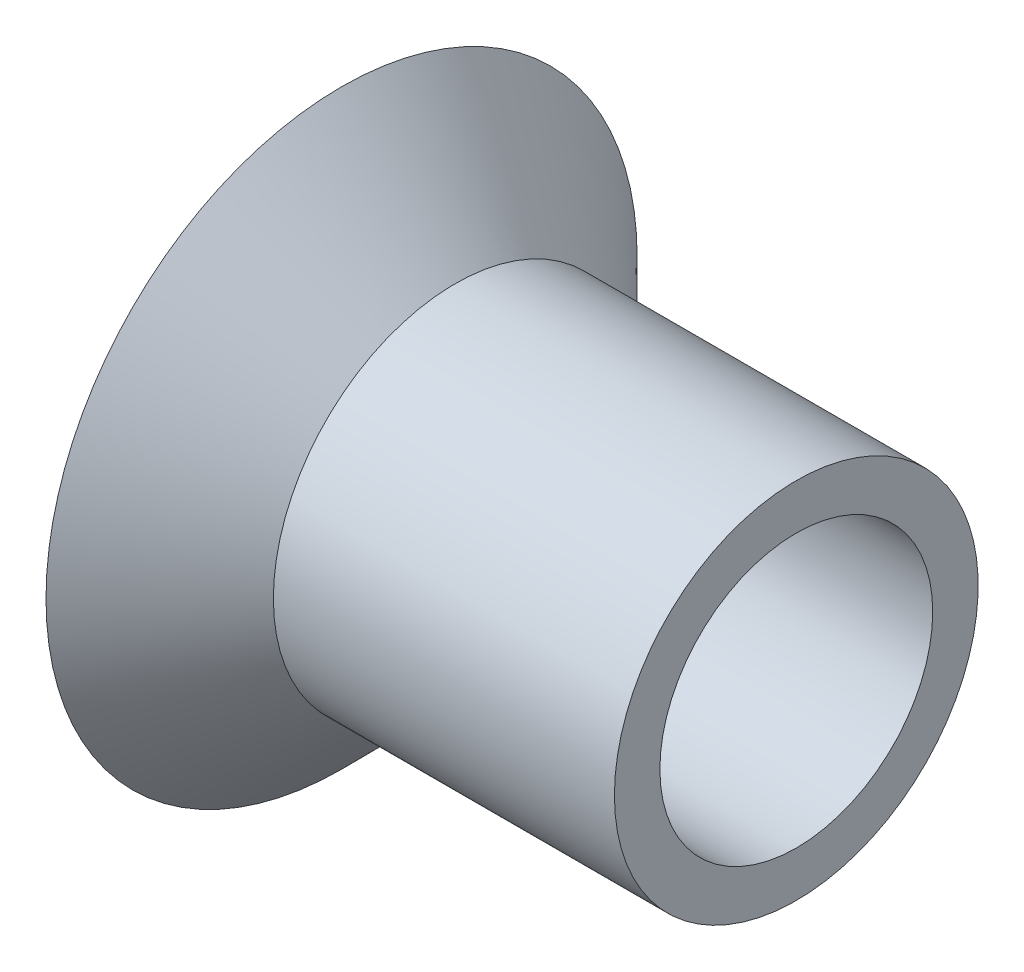
ISO-10303-21;
HEADER;
FILE_DESCRIPTION(('STEP AP214'),'2;1');
FILE_NAME('part.step','',(''),(''),'','','');
FILE_SCHEMA(('AUTOMOTIVE_DESIGN { 1 0 10303 214 1 1 1 1 }'));
ENDSEC;
DATA;
#1=APPLICATION_CONTEXT('core data for automotive mechanical design processes');
#2=APPLICATION_PROTOCOL_DEFINITION('international standard','automotive_design',2000,#1);
#3=PRODUCT_CONTEXT('',#1,'mechanical');
#4=PRODUCT('Part','Part','',(#3));
#5=PRODUCT_RELATED_PRODUCT_CATEGORY('part','',(#4));
#6=PRODUCT_DEFINITION_FORMATION('','',#4);
#7=PRODUCT_DEFINITION_CONTEXT('part definition',#1,'design');
#8=PRODUCT_DEFINITION('design','',#6,#7);
#9=PRODUCT_DEFINITION_SHAPE('','',#8);
#10=(LENGTH_UNIT() NAMED_UNIT(*) SI_UNIT(.MILLI.,.METRE.));
#11=(NAMED_UNIT(*) PLANE_ANGLE_UNIT() SI_UNIT($,.RADIAN.));
#12=(NAMED_UNIT(*) SI_UNIT($,.STERADIAN.) SOLID_ANGLE_UNIT());
#13=UNCERTAINTY_MEASURE_WITH_UNIT(LENGTH_MEASURE(1.E-05),#10,'distance_accuracy_value','');
#14=(GEOMETRIC_REPRESENTATION_CONTEXT(3) GLOBAL_UNCERTAINTY_ASSIGNED_CONTEXT((#13)) GLOBAL_UNIT_ASSIGNED_CONTEXT((#10,
#11,#12)) REPRESENTATION_CONTEXT('',''));
#15=CARTESIAN_POINT('',(0.,0.,0.));
#16=DIRECTION('',(0.,0.,1.));
#17=DIRECTION('',(1.,0.,0.));
#18=AXIS2_PLACEMENT_3D('',#15,#16,#17);
#19=CARTESIAN_POINT('',(5.,3.99999999999999,0.));
#20=DIRECTION('',(-1.,0.,0.));
#21=DIRECTION('',(0.,0.,1.));
#22=AXIS2_PLACEMENT_3D('',#19,#20,#21);
#23=PLANE('',#22);
#24=CARTESIAN_POINT('',(5.,0.,0.));
#25=DIRECTION('',(-1.,0.,0.));
#26=DIRECTION('',(0.,0.,1.));
#27=AXIS2_PLACEMENT_3D('',#24,#25,#26);
#28=CIRCLE('',#27,3.99999999999999);
#29=CARTESIAN_POINT('',(5.,0.,3.99999999999999));
#30=VERTEX_POINT('',#29);
#31=EDGE_CURVE('E53',#30,#30,#28,.T.);
#32=ORIENTED_EDGE('',*,*,#31,.F.);
#33=EDGE_LOOP('',(#32));
#34=FACE_BOUND('',#33,.T.);
#35=CARTESIAN_POINT('',(5.,0.,0.));
#36=DIRECTION('',(-1.,0.,0.));
#37=DIRECTION('',(0.,0.,1.));
#38=AXIS2_PLACEMENT_3D('',#35,#36,#37);
#39=CIRCLE('',#38,2.99999999999999);
#40=CARTESIAN_POINT('',(5.,0.,2.99999999999999));
#41=VERTEX_POINT('',#40);
#42=EDGE_CURVE('E10',#41,#41,#39,.T.);
#43=ORIENTED_EDGE('',*,*,#42,.T.);
#44=EDGE_LOOP('',(#43));
#45=FACE_BOUND('',#44,.T.);
#46=ADVANCED_FACE('F31',(#34,#45),#23,.F.);
#47=CARTESIAN_POINT('',(-9.57962245942667,0.,0.));
#48=DIRECTION('',(-1.,0.,0.));
#49=DIRECTION('',(0.,0.,1.));
#50=AXIS2_PLACEMENT_3D('',#47,#48,#49);
#51=CYLINDRICAL_SURFACE('',#50,3.);
#52=ORIENTED_EDGE('',*,*,#42,.F.);
#53=EDGE_LOOP('',(#52));
#54=FACE_BOUND('',#53,.T.);
#55=CARTESIAN_POINT('',(-2.91421356237313,0.,0.));
#56=DIRECTION('',(-1.,0.,0.));
#57=DIRECTION('',(0.,0.,1.));
#58=AXIS2_PLACEMENT_3D('',#55,#56,#57);
#59=CIRCLE('',#58,3.);
#60=CARTESIAN_POINT('',(-2.91421356237313,0.,3.));
#61=VERTEX_POINT('',#60);
#62=EDGE_CURVE('E37',#61,#61,#59,.T.);
#63=ORIENTED_EDGE('',*,*,#62,.T.);
#64=EDGE_LOOP('',(#63));
#65=FACE_BOUND('',#64,.T.);
#66=ADVANCED_FACE('F60',(#54,#65),#51,.F.);
#67=CARTESIAN_POINT('',(-5.,0.,0.));
#68=DIRECTION('',(-1.,0.,0.));
#69=DIRECTION('',(0.,0.,1.));
#70=AXIS2_PLACEMENT_3D('',#67,#68,#69);
#71=CONICAL_SURFACE('',#70,5.08578643762689,0.785398163397453);
#72=ORIENTED_EDGE('',*,*,#62,.F.);
#73=EDGE_LOOP('',(#72));
#74=FACE_BOUND('',#73,.T.);
#75=CARTESIAN_POINT('',(-5.,0.,0.));
#76=DIRECTION('',(-1.,0.,0.));
#77=DIRECTION('',(0.,0.,1.));
#78=AXIS2_PLACEMENT_3D('',#75,#76,#77);
#79=CIRCLE('',#78,5.08578643762689);
#80=CARTESIAN_POINT('',(-5.,0.,5.08578643762689));
#81=VERTEX_POINT('',#80);
#82=EDGE_CURVE('E41',#81,#81,#79,.T.);
#83=ORIENTED_EDGE('',*,*,#82,.T.);
#84=EDGE_LOOP('',(#83));
#85=FACE_BOUND('',#84,.T.);
#86=ADVANCED_FACE('F64',(#74,#85),#71,.F.);
#87=CARTESIAN_POINT('',(-5.,6.49999999999999,0.));
#88=DIRECTION('',(1.,0.,0.));
#89=DIRECTION('',(0.,0.,-1.));
#90=AXIS2_PLACEMENT_3D('',#87,#88,#89);
#91=PLANE('',#90);
#92=ORIENTED_EDGE('',*,*,#82,.F.);
#93=EDGE_LOOP('',(#92));
#94=FACE_BOUND('',#93,.T.);
#95=CARTESIAN_POINT('',(-5.,0.,0.));
#96=DIRECTION('',(-1.,0.,0.));
#97=DIRECTION('',(0.,0.,1.));
#98=AXIS2_PLACEMENT_3D('',#95,#96,#97);
#99=CIRCLE('',#98,6.49999999999999);
#100=CARTESIAN_POINT('',(-5.,0.,6.49999999999999));
#101=VERTEX_POINT('',#100);
#102=EDGE_CURVE('E45',#101,#101,#99,.T.);
#103=ORIENTED_EDGE('',*,*,#102,.T.);
#104=EDGE_LOOP('',(#103));
#105=FACE_BOUND('',#104,.T.);
#106=ADVANCED_FACE('F69',(#94,#105),#91,.F.);
#107=CARTESIAN_POINT('',(-2.50000000000004,0.,0.));
#108=DIRECTION('',(-1.,0.,0.));
#109=DIRECTION('',(0.,0.,1.));
#110=AXIS2_PLACEMENT_3D('',#107,#108,#109);
#111=CONICAL_SURFACE('',#110,4.,0.785398163397454);
#112=ORIENTED_EDGE('',*,*,#102,.F.);
#113=EDGE_LOOP('',(#112));
#114=FACE_BOUND('',#113,.T.);
#115=CARTESIAN_POINT('',(-2.50000000000004,0.,0.));
#116=DIRECTION('',(-1.,0.,0.));
#117=DIRECTION('',(0.,0.,1.));
#118=AXIS2_PLACEMENT_3D('',#115,#116,#117);
#119=CIRCLE('',#118,4.);
#120=CARTESIAN_POINT('',(-2.50000000000004,0.,4.));
#121=VERTEX_POINT('',#120);
#122=EDGE_CURVE('E50',#121,#121,#119,.T.);
#123=ORIENTED_EDGE('',*,*,#122,.T.);
#124=EDGE_LOOP('',(#123));
#125=FACE_BOUND('',#124,.T.);
#126=ADVANCED_FACE('F75',(#114,#125),#111,.T.);
#127=CARTESIAN_POINT('',(-9.57962245942667,0.,0.));
#128=DIRECTION('',(-1.,0.,0.));
#129=DIRECTION('',(0.,0.,1.));
#130=AXIS2_PLACEMENT_3D('',#127,#128,#129);
#131=CYLINDRICAL_SURFACE('',#130,4.);
#132=ORIENTED_EDGE('',*,*,#122,.F.);
#133=EDGE_LOOP('',(#132));
#134=FACE_BOUND('',#133,.T.);
#135=ORIENTED_EDGE('',*,*,#31,.T.);
#136=EDGE_LOOP('',(#135));
#137=FACE_BOUND('',#136,.T.);
#138=ADVANCED_FACE('F57',(#134,#137),#131,.T.);
#139=CLOSED_SHELL('',(#46,#66,#86,#106,#126,#138));
#140=MANIFOLD_SOLID_BREP('B2',#139);
#141=ADVANCED_BREP_SHAPE_REPRESENTATION('',(#18,#140),#14);
#142=SHAPE_DEFINITION_REPRESENTATION(#9,#141);
ENDSEC;
END-ISO-10303-21;
